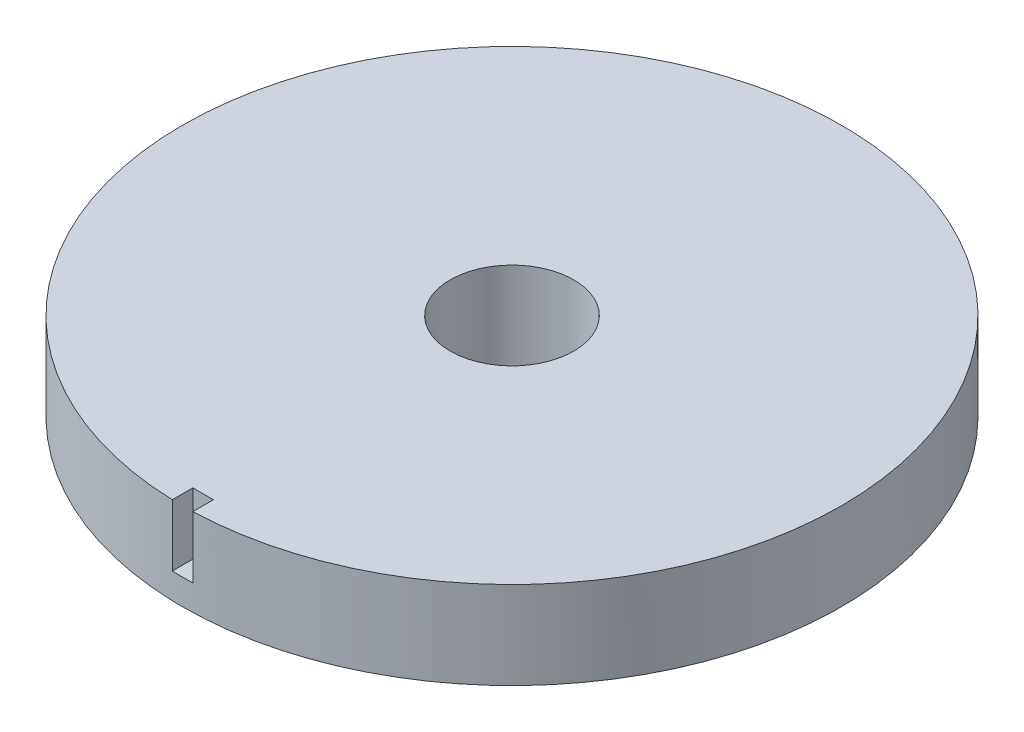
ISO-10303-21;
HEADER;
FILE_DESCRIPTION(('STEP AP214'),'2;1');
FILE_NAME('part.step','',(''),(''),'','','');
FILE_SCHEMA(('AUTOMOTIVE_DESIGN { 1 0 10303 214 1 1 1 1 }'));
ENDSEC;
DATA;
#1=APPLICATION_CONTEXT('core data for automotive mechanical design processes');
#2=APPLICATION_PROTOCOL_DEFINITION('international standard','automotive_design',2000,#1);
#3=PRODUCT_CONTEXT('',#1,'mechanical');
#4=PRODUCT('Part','Part','',(#3));
#5=PRODUCT_RELATED_PRODUCT_CATEGORY('part','',(#4));
#6=PRODUCT_DEFINITION_FORMATION('','',#4);
#7=PRODUCT_DEFINITION_CONTEXT('part definition',#1,'design');
#8=PRODUCT_DEFINITION('design','',#6,#7);
#9=PRODUCT_DEFINITION_SHAPE('','',#8);
#10=(LENGTH_UNIT() NAMED_UNIT(*) SI_UNIT(.MILLI.,.METRE.));
#11=(NAMED_UNIT(*) PLANE_ANGLE_UNIT() SI_UNIT($,.RADIAN.));
#12=(NAMED_UNIT(*) SI_UNIT($,.STERADIAN.) SOLID_ANGLE_UNIT());
#13=UNCERTAINTY_MEASURE_WITH_UNIT(LENGTH_MEASURE(1.E-05),#10,'distance_accuracy_value','');
#14=(GEOMETRIC_REPRESENTATION_CONTEXT(3) GLOBAL_UNCERTAINTY_ASSIGNED_CONTEXT((#13)) GLOBAL_UNIT_ASSIGNED_CONTEXT((#10,
#11,#12)) REPRESENTATION_CONTEXT('',''));
#15=CARTESIAN_POINT('',(0.,0.,0.));
#16=DIRECTION('',(0.,0.,1.));
#17=DIRECTION('',(1.,0.,0.));
#18=AXIS2_PLACEMENT_3D('',#15,#16,#17);
#19=CARTESIAN_POINT('',(0.,4.25,0.));
#20=DIRECTION('',(0.,1.,0.));
#21=DIRECTION('',(0.,0.,1.));
#22=AXIS2_PLACEMENT_3D('',#19,#20,#21);
#23=PLANE('',#22);
#24=CARTESIAN_POINT('',(0.,4.25,0.));
#25=DIRECTION('',(0.,1.,0.));
#26=DIRECTION('',(0.,0.,1.));
#27=AXIS2_PLACEMENT_3D('',#24,#25,#26);
#28=CIRCLE('',#27,3.);
#29=CARTESIAN_POINT('',(0.,4.25,3.));
#30=VERTEX_POINT('',#29);
#31=EDGE_CURVE('E107',#30,#30,#28,.T.);
#32=ORIENTED_EDGE('',*,*,#31,.F.);
#33=EDGE_LOOP('',(#32));
#34=FACE_BOUND('',#33,.T.);
#35=CARTESIAN_POINT('',(0.,4.25,0.));
#36=DIRECTION('',(0.,1.,0.));
#37=DIRECTION('',(0.,0.,1.));
#38=AXIS2_PLACEMENT_3D('',#35,#36,#37);
#39=CIRCLE('',#38,16.);
#40=CARTESIAN_POINT('',(0.500000000000006,4.25,15.9921855917195));
#41=VERTEX_POINT('',#40);
#42=CARTESIAN_POINT('',(-0.500000000000002,4.25,15.9921855917195));
#43=VERTEX_POINT('',#42);
#44=EDGE_CURVE('E11',#41,#43,#39,.T.);
#45=ORIENTED_EDGE('',*,*,#44,.T.);
#46=DIRECTION('',(0.,0.,-1.));
#47=VECTOR('',#46,1.);
#48=CARTESIAN_POINT('',(-0.5,4.25,15.9921855917195));
#49=LINE('',#48,#47);
#50=CARTESIAN_POINT('',(-0.500000000000002,4.25,14.9921855917195));
#51=VERTEX_POINT('',#50);
#52=EDGE_CURVE('E56',#43,#51,#49,.T.);
#53=ORIENTED_EDGE('',*,*,#52,.T.);
#54=CARTESIAN_POINT('',(0.,4.25,-1.));
#55=DIRECTION('',(0.,-1.,0.));
#56=DIRECTION('',(0.,0.,-1.));
#57=AXIS2_PLACEMENT_3D('',#54,#55,#56);
#58=CIRCLE('',#57,16.);
#59=CARTESIAN_POINT('',(0.500000000000006,4.25,14.9921855917195));
#60=VERTEX_POINT('',#59);
#61=EDGE_CURVE('E74',#60,#51,#58,.T.);
#62=ORIENTED_EDGE('',*,*,#61,.F.);
#63=DIRECTION('',(0.,0.,-1.));
#64=VECTOR('',#63,1.);
#65=CARTESIAN_POINT('',(0.5,4.25,15.9921855917195));
#66=LINE('',#65,#64);
#67=EDGE_CURVE('E83',#41,#60,#66,.T.);
#68=ORIENTED_EDGE('',*,*,#67,.F.);
#69=EDGE_LOOP('',(#45,#53,#62,#68));
#70=FACE_BOUND('',#69,.T.);
#71=ADVANCED_FACE('F32',(#34,#70),#23,.T.);
#72=CARTESIAN_POINT('',(0.,4.25,0.));
#73=DIRECTION('',(0.,-1.,0.));
#74=DIRECTION('',(0.,0.,-1.));
#75=AXIS2_PLACEMENT_3D('',#72,#73,#74);
#76=CYLINDRICAL_SURFACE('',#75,16.);
#77=CARTESIAN_POINT('',(0.,0.,0.));
#78=DIRECTION('',(0.,1.,0.));
#79=DIRECTION('',(0.,0.,1.));
#80=AXIS2_PLACEMENT_3D('',#77,#78,#79);
#81=CIRCLE('',#80,16.);
#82=CARTESIAN_POINT('',(0.,0.,16.));
#83=VERTEX_POINT('',#82);
#84=EDGE_CURVE('E36',#83,#83,#81,.T.);
#85=ORIENTED_EDGE('',*,*,#84,.T.);
#86=EDGE_LOOP('',(#85));
#87=FACE_BOUND('',#86,.T.);
#88=DIRECTION('',(0.,-1.,0.));
#89=VECTOR('',#88,1.);
#90=CARTESIAN_POINT('',(-0.5,4.25,15.9921855917195));
#91=LINE('',#90,#89);
#92=CARTESIAN_POINT('',(-0.499999999999999,1.25,15.9921855917195));
#93=VERTEX_POINT('',#92);
#94=EDGE_CURVE('E92',#43,#93,#91,.T.);
#95=ORIENTED_EDGE('',*,*,#94,.F.);
#96=ORIENTED_EDGE('',*,*,#44,.F.);
#97=DIRECTION('',(0.,-1.,0.));
#98=VECTOR('',#97,1.);
#99=CARTESIAN_POINT('',(0.5,4.25,15.9921855917195));
#100=LINE('',#99,#98);
#101=CARTESIAN_POINT('',(0.5,1.25,15.9921855917195));
#102=VERTEX_POINT('',#101);
#103=EDGE_CURVE('E79',#41,#102,#100,.T.);
#104=ORIENTED_EDGE('',*,*,#103,.T.);
#105=CARTESIAN_POINT('',(0.,1.25,0.));
#106=DIRECTION('',(0.,1.,0.));
#107=DIRECTION('',(-1.,0.,0.));
#108=AXIS2_PLACEMENT_3D('',#105,#106,#107);
#109=CIRCLE('',#108,16.);
#110=EDGE_CURVE('E47',#93,#102,#109,.T.);
#111=ORIENTED_EDGE('',*,*,#110,.F.);
#112=EDGE_LOOP('',(#95,#96,#104,#111));
#113=FACE_BOUND('',#112,.T.);
#114=ADVANCED_FACE('F34',(#87,#113),#76,.T.);
#115=CARTESIAN_POINT('',(0.,0.,0.));
#116=DIRECTION('',(0.,1.,0.));
#117=DIRECTION('',(0.,0.,1.));
#118=AXIS2_PLACEMENT_3D('',#115,#116,#117);
#119=PLANE('',#118);
#120=ORIENTED_EDGE('',*,*,#84,.F.);
#121=EDGE_LOOP('',(#120));
#122=FACE_BOUND('',#121,.T.);
#123=CARTESIAN_POINT('',(0.,0.,0.));
#124=DIRECTION('',(0.,1.,0.));
#125=DIRECTION('',(0.,0.,1.));
#126=AXIS2_PLACEMENT_3D('',#123,#124,#125);
#127=CIRCLE('',#126,3.);
#128=CARTESIAN_POINT('',(0.,0.,3.));
#129=VERTEX_POINT('',#128);
#130=EDGE_CURVE('E87',#129,#129,#127,.T.);
#131=ORIENTED_EDGE('',*,*,#130,.T.);
#132=EDGE_LOOP('',(#131));
#133=FACE_BOUND('',#132,.T.);
#134=ADVANCED_FACE('F113',(#122,#133),#119,.F.);
#135=CARTESIAN_POINT('',(0.,4.25,0.));
#136=DIRECTION('',(0.,-1.,0.));
#137=DIRECTION('',(0.,0.,-1.));
#138=AXIS2_PLACEMENT_3D('',#135,#136,#137);
#139=CYLINDRICAL_SURFACE('',#138,3.);
#140=ORIENTED_EDGE('',*,*,#31,.T.);
#141=EDGE_LOOP('',(#140));
#142=FACE_BOUND('',#141,.T.);
#143=ORIENTED_EDGE('',*,*,#130,.F.);
#144=EDGE_LOOP('',(#143));
#145=FACE_BOUND('',#144,.T.);
#146=ADVANCED_FACE('F115',(#142,#145),#139,.F.);
#147=CARTESIAN_POINT('',(0.,4.25,-1.));
#148=DIRECTION('',(0.,-1.,0.));
#149=DIRECTION('',(0.,0.,-1.));
#150=AXIS2_PLACEMENT_3D('',#147,#148,#149);
#151=CYLINDRICAL_SURFACE('',#150,16.);
#152=DIRECTION('',(0.,-1.,0.));
#153=VECTOR('',#152,1.);
#154=CARTESIAN_POINT('',(0.5,4.25,14.9921855917195));
#155=LINE('',#154,#153);
#156=CARTESIAN_POINT('',(0.5,1.25,14.9921855917195));
#157=VERTEX_POINT('',#156);
#158=EDGE_CURVE('E88',#60,#157,#155,.T.);
#159=ORIENTED_EDGE('',*,*,#158,.F.);
#160=ORIENTED_EDGE('',*,*,#61,.T.);
#161=DIRECTION('',(0.,-1.,0.));
#162=VECTOR('',#161,1.);
#163=CARTESIAN_POINT('',(-0.5,4.25,14.9921855917195));
#164=LINE('',#163,#162);
#165=CARTESIAN_POINT('',(-0.499999999999999,1.25,14.9921855917195));
#166=VERTEX_POINT('',#165);
#167=EDGE_CURVE('E95',#51,#166,#164,.T.);
#168=ORIENTED_EDGE('',*,*,#167,.T.);
#169=CARTESIAN_POINT('',(0.,1.25,-1.));
#170=DIRECTION('',(0.,1.,0.));
#171=DIRECTION('',(-1.,0.,0.));
#172=AXIS2_PLACEMENT_3D('',#169,#170,#171);
#173=CIRCLE('',#172,16.);
#174=EDGE_CURVE('E97',#166,#157,#173,.T.);
#175=ORIENTED_EDGE('',*,*,#174,.T.);
#176=EDGE_LOOP('',(#159,#160,#168,#175));
#177=FACE_BOUND('',#176,.T.);
#178=ADVANCED_FACE('F117',(#177),#151,.T.);
#179=CARTESIAN_POINT('',(-0.5,4.25,15.9921855917195));
#180=DIRECTION('',(1.,0.,0.));
#181=DIRECTION('',(0.,0.,-1.));
#182=AXIS2_PLACEMENT_3D('',#179,#180,#181);
#183=PLANE('',#182);
#184=ORIENTED_EDGE('',*,*,#167,.F.);
#185=ORIENTED_EDGE('',*,*,#52,.F.);
#186=ORIENTED_EDGE('',*,*,#94,.T.);
#187=DIRECTION('',(0.,0.,-1.));
#188=VECTOR('',#187,1.);
#189=CARTESIAN_POINT('',(-0.5,1.25,15.9921855917195));
#190=LINE('',#189,#188);
#191=EDGE_CURVE('E94',#93,#166,#190,.T.);
#192=ORIENTED_EDGE('',*,*,#191,.T.);
#193=EDGE_LOOP('',(#184,#185,#186,#192));
#194=FACE_BOUND('',#193,.T.);
#195=ADVANCED_FACE('F124',(#194),#183,.T.);
#196=CARTESIAN_POINT('',(0.5,1.25,15.9921855917195));
#197=DIRECTION('',(0.,1.,0.));
#198=DIRECTION('',(-1.,0.,0.));
#199=AXIS2_PLACEMENT_3D('',#196,#197,#198);
#200=PLANE('',#199);
#201=ORIENTED_EDGE('',*,*,#174,.F.);
#202=ORIENTED_EDGE('',*,*,#191,.F.);
#203=ORIENTED_EDGE('',*,*,#110,.T.);
#204=DIRECTION('',(0.,0.,-1.));
#205=VECTOR('',#204,1.);
#206=CARTESIAN_POINT('',(0.5,1.25,15.9921855917195));
#207=LINE('',#206,#205);
#208=EDGE_CURVE('E84',#102,#157,#207,.T.);
#209=ORIENTED_EDGE('',*,*,#208,.T.);
#210=EDGE_LOOP('',(#201,#202,#203,#209));
#211=FACE_BOUND('',#210,.T.);
#212=ADVANCED_FACE('F129',(#211),#200,.T.);
#213=CARTESIAN_POINT('',(0.5,4.25,15.9921855917195));
#214=DIRECTION('',(1.,0.,0.));
#215=DIRECTION('',(0.,0.,-1.));
#216=AXIS2_PLACEMENT_3D('',#213,#214,#215);
#217=PLANE('',#216);
#218=ORIENTED_EDGE('',*,*,#158,.T.);
#219=ORIENTED_EDGE('',*,*,#208,.F.);
#220=ORIENTED_EDGE('',*,*,#103,.F.);
#221=ORIENTED_EDGE('',*,*,#67,.T.);
#222=EDGE_LOOP('',(#218,#219,#220,#221));
#223=FACE_BOUND('',#222,.T.);
#224=ADVANCED_FACE('F82',(#223),#217,.F.);
#225=CLOSED_SHELL('',(#71,#114,#134,#146,#178,#195,#212,#224));
#226=MANIFOLD_SOLID_BREP('B2',#225);
#227=ADVANCED_BREP_SHAPE_REPRESENTATION('',(#18,#226),#14);
#228=SHAPE_DEFINITION_REPRESENTATION(#9,#227);
ENDSEC;
END-ISO-10303-21;
